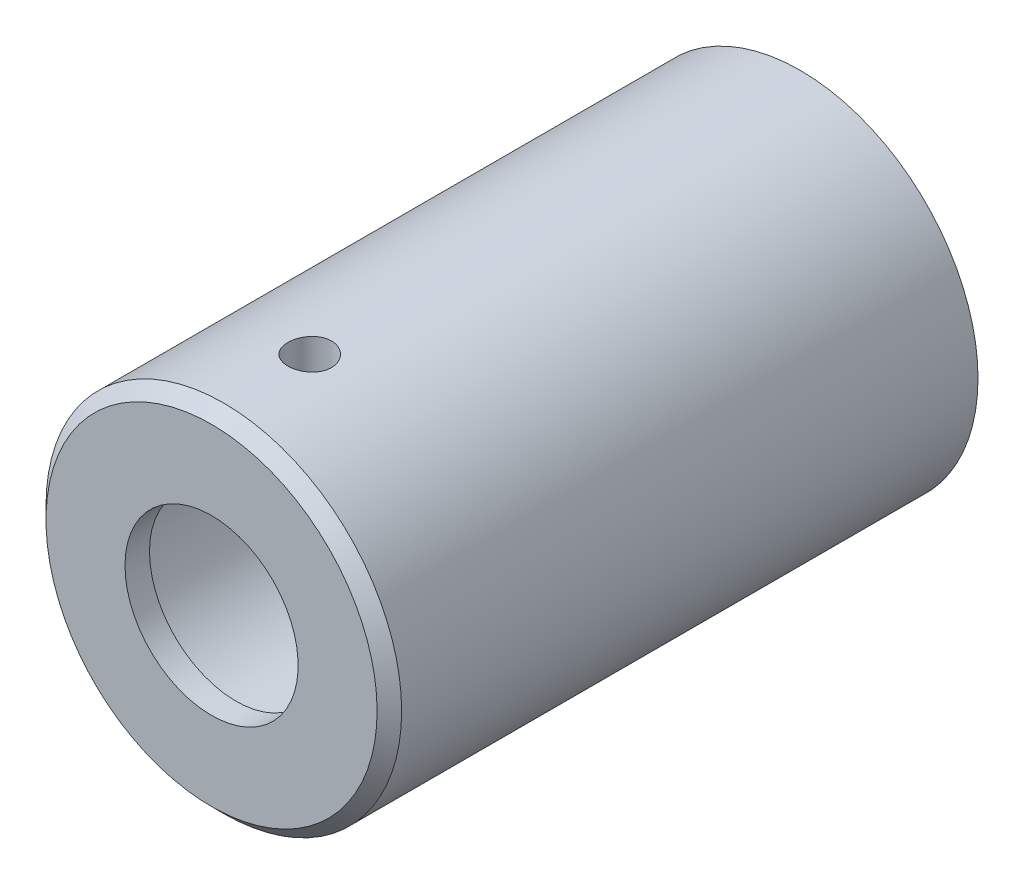
ISO-10303-21;
HEADER;
FILE_DESCRIPTION(('STEP AP214'),'2;1');
FILE_NAME('part.step','',(''),(''),'','','');
FILE_SCHEMA(('AUTOMOTIVE_DESIGN { 1 0 10303 214 1 1 1 1 }'));
ENDSEC;
DATA;
#1=APPLICATION_CONTEXT('core data for automotive mechanical design processes');
#2=APPLICATION_PROTOCOL_DEFINITION('international standard','automotive_design',2000,#1);
#3=PRODUCT_CONTEXT('',#1,'mechanical');
#4=PRODUCT('Part','Part','',(#3));
#5=PRODUCT_RELATED_PRODUCT_CATEGORY('part','',(#4));
#6=PRODUCT_DEFINITION_FORMATION('','',#4);
#7=PRODUCT_DEFINITION_CONTEXT('part definition',#1,'design');
#8=PRODUCT_DEFINITION('design','',#6,#7);
#9=PRODUCT_DEFINITION_SHAPE('','',#8);
#10=(LENGTH_UNIT() NAMED_UNIT(*) SI_UNIT(.MILLI.,.METRE.));
#11=(NAMED_UNIT(*) PLANE_ANGLE_UNIT() SI_UNIT($,.RADIAN.));
#12=(NAMED_UNIT(*) SI_UNIT($,.STERADIAN.) SOLID_ANGLE_UNIT());
#13=UNCERTAINTY_MEASURE_WITH_UNIT(LENGTH_MEASURE(1.E-05),#10,'distance_accuracy_value','');
#14=(GEOMETRIC_REPRESENTATION_CONTEXT(3) GLOBAL_UNCERTAINTY_ASSIGNED_CONTEXT((#13)) GLOBAL_UNIT_ASSIGNED_CONTEXT((#10,
#11,#12)) REPRESENTATION_CONTEXT('',''));
#15=CARTESIAN_POINT('',(0.,0.,0.));
#16=DIRECTION('',(0.,0.,1.));
#17=DIRECTION('',(1.,0.,0.));
#18=AXIS2_PLACEMENT_3D('',#15,#16,#17);
#19=CARTESIAN_POINT('',(0.,4.53,-24.));
#20=DIRECTION('',(0.,0.,-1.));
#21=DIRECTION('',(-1.,0.,0.));
#22=AXIS2_PLACEMENT_3D('',#19,#20,#21);
#23=PLANE('',#22);
#24=CARTESIAN_POINT('',(0.,0.,-24.));
#25=DIRECTION('',(0.,0.,-1.));
#26=DIRECTION('',(-1.,0.,0.));
#27=AXIS2_PLACEMENT_3D('',#24,#25,#26);
#28=CIRCLE('',#27,7.25);
#29=CARTESIAN_POINT('',(-7.25,0.,-24.));
#30=VERTEX_POINT('',#29);
#31=EDGE_CURVE('E43',#30,#30,#28,.T.);
#32=ORIENTED_EDGE('',*,*,#31,.T.);
#33=EDGE_LOOP('',(#32));
#34=FACE_BOUND('',#33,.T.);
#35=CARTESIAN_POINT('',(0.,0.,-24.));
#36=DIRECTION('',(0.,0.,-1.));
#37=DIRECTION('',(-1.,0.,0.));
#38=AXIS2_PLACEMENT_3D('',#35,#36,#37);
#39=CIRCLE('',#38,4.53);
#40=CARTESIAN_POINT('',(-4.53,0.,-24.));
#41=VERTEX_POINT('',#40);
#42=EDGE_CURVE('E58',#41,#41,#39,.T.);
#43=ORIENTED_EDGE('',*,*,#42,.F.);
#44=EDGE_LOOP('',(#43));
#45=FACE_BOUND('',#44,.T.);
#46=ADVANCED_FACE('F32',(#34,#45),#23,.T.);
#47=CARTESIAN_POINT('',(0.,0.,0.));
#48=DIRECTION('',(0.,0.,-1.));
#49=DIRECTION('',(-1.,0.,0.));
#50=AXIS2_PLACEMENT_3D('',#47,#48,#49);
#51=CYLINDRICAL_SURFACE('',#50,7.25);
#52=CARTESIAN_POINT('',(0.,0.,-0.499999999999999));
#53=DIRECTION('',(0.,0.,1.));
#54=DIRECTION('',(1.,0.,0.));
#55=AXIS2_PLACEMENT_3D('',#52,#53,#54);
#56=CIRCLE('',#55,7.25);
#57=CARTESIAN_POINT('',(7.25,0.,-0.499999999999999));
#58=VERTEX_POINT('',#57);
#59=EDGE_CURVE('E39',#58,#58,#56,.F.);
#60=ORIENTED_EDGE('',*,*,#59,.T.);
#61=EDGE_LOOP('',(#60));
#62=FACE_BOUND('',#61,.T.);
#63=CARTESIAN_POINT('',(0.,7.25,-3.11100000000001));
#64=CARTESIAN_POINT('',(0.0497352922699092,7.24999931697813,-3.11100211761038));
#65=CARTESIAN_POINT('',(0.0995018523333256,7.24948281239291,-3.11518774716117));
#66=CARTESIAN_POINT('',(0.197650674020543,7.24747205372098,-3.13181927393568));
#67=CARTESIAN_POINT('',(0.246031426156918,7.24597677284092,-3.14427384595787));
#68=CARTESIAN_POINT('',(0.339973476370009,7.24217694854555,-3.17707125905344));
#69=CARTESIAN_POINT('',(0.38553662858214,7.23987294412588,-3.19740884721691));
#70=CARTESIAN_POINT('',(0.472594314353672,7.2347120683669,-3.24538362497414));
#71=CARTESIAN_POINT('',(0.514089555668255,7.23185529345944,-3.27301954166703));
#72=CARTESIAN_POINT('',(0.592062498387777,7.22589099328054,-3.33496332942016));
#73=CARTESIAN_POINT('',(0.628515509153612,7.22278234466244,-3.3693021752525));
#74=CARTESIAN_POINT('',(0.695156622414393,7.21667374242024,-3.44361059622368));
#75=CARTESIAN_POINT('',(0.725344408829311,7.21367379428638,-3.48358045527595));
#76=CARTESIAN_POINT('',(0.778689694627338,7.20811116600053,-3.56817620015927));
#77=CARTESIAN_POINT('',(0.80182413660203,7.20554993171128,-3.61281672903529));
#78=CARTESIAN_POINT('',(0.840258784697372,7.20116946177545,-3.70538588200392));
#79=CARTESIAN_POINT('',(0.855559276941294,7.19935019902995,-3.75331438593566));
#80=CARTESIAN_POINT('',(0.877816844413402,7.19667033484917,-3.85084311284086));
#81=CARTESIAN_POINT('',(0.884815544037141,7.19580495230992,-3.90043370282685));
#82=CARTESIAN_POINT('',(0.890399645288686,7.19511618002055,-4.00009252374081));
#83=CARTESIAN_POINT('',(0.8889853729239,7.19529274989418,-4.05016073608559));
#84=CARTESIAN_POINT('',(0.877817858973771,7.19666355739408,-4.14906379228413));
#85=CARTESIAN_POINT('',(0.868110426056394,7.19785220452091,-4.19790389705066));
#86=CARTESIAN_POINT('',(0.840703601632715,7.20110451541398,-4.29325658464418));
#87=CARTESIAN_POINT('',(0.823004053789628,7.20316819629703,-4.33976912192097));
#88=CARTESIAN_POINT('',(0.780066049087814,7.20794439905849,-4.42928891435415));
#89=CARTESIAN_POINT('',(0.754807642233926,7.21065863411415,-4.47228650540085));
#90=CARTESIAN_POINT('',(0.697483191088242,7.2164287828661,-4.55344997901832));
#91=CARTESIAN_POINT('',(0.665416847107145,7.21948471160115,-4.59161564876703));
#92=CARTESIAN_POINT('',(0.595132687336998,7.22561878012687,-4.66229781656556));
#93=CARTESIAN_POINT('',(0.556875378804248,7.22869693246896,-4.69477505606742));
#94=CARTESIAN_POINT('',(0.47543137341361,7.23450958511776,-4.75285292422503));
#95=CARTESIAN_POINT('',(0.432244665906794,7.23724408468207,-4.77845353802488));
#96=CARTESIAN_POINT('',(0.342137820428609,7.24206293476913,-4.82205130889416));
#97=CARTESIAN_POINT('',(0.295216504987598,7.24414707921677,-4.84004605656581));
#98=CARTESIAN_POINT('',(0.198987041047732,7.24742850301708,-4.86789037524585));
#99=CARTESIAN_POINT('',(0.149679000159433,7.24862582231453,-4.87774031311876));
#100=CARTESIAN_POINT('',(0.0504152632149692,7.24999350483213,-4.88896463920892));
#101=CARTESIAN_POINT('',(0.00046577018452016,7.25017042185076,-4.89039311775059));
#102=CARTESIAN_POINT('',(-0.098960699388949,7.24949504839123,-4.88487665017888));
#103=CARTESIAN_POINT('',(-0.148437685586031,7.24864277898653,-4.8779318755148));
#104=CARTESIAN_POINT('',(-0.24535543245841,7.24600888960808,-4.85591096733972));
#105=CARTESIAN_POINT('',(-0.292802128916307,7.2442302123803,-4.84086057629803));
#106=CARTESIAN_POINT('',(-0.384498038582742,7.23994268370676,-4.80308239203133));
#107=CARTESIAN_POINT('',(-0.42874714690492,7.23743380832281,-4.78035434710478));
#108=CARTESIAN_POINT('',(-0.513033693913479,7.23194934772569,-4.72773481096242));
#109=CARTESIAN_POINT('',(-0.55304910391103,7.22897150458495,-4.69780827330644));
#110=CARTESIAN_POINT('',(-0.627508361609754,7.22288941614302,-4.63169090706813));
#111=CARTESIAN_POINT('',(-0.661951996692432,7.21978516602381,-4.59549983954086));
#112=CARTESIAN_POINT('',(-0.724481460861173,7.21377996280567,-4.51764271202781));
#113=CARTESIAN_POINT('',(-0.752531471234871,7.21088021500843,-4.47594777846041));
#114=CARTESIAN_POINT('',(-0.801230126476004,7.20563201576895,-4.38840683481175));
#115=CARTESIAN_POINT('',(-0.821878914974824,7.20328355362852,-4.3425609053082));
#116=CARTESIAN_POINT('',(-0.855130786926389,7.19941197365016,-4.2481356973801));
#117=CARTESIAN_POINT('',(-0.867754181583738,7.19788677373559,-4.19956366055365));
#118=CARTESIAN_POINT('',(-0.884662397035577,7.19582838740433,-4.10096942415094));
#119=CARTESIAN_POINT('',(-0.888947589957609,7.19529515671684,-4.05094728939256));
#120=CARTESIAN_POINT('',(-0.889051108746924,7.19528233795547,-3.95122911031408));
#121=CARTESIAN_POINT('',(-0.884925705720508,7.19579574733304,-3.90153311590346));
#122=CARTESIAN_POINT('',(-0.868444175055759,7.19780331840889,-3.80354645213736));
#123=CARTESIAN_POINT('',(-0.856088045521923,7.19929748033304,-3.75525578310552));
#124=CARTESIAN_POINT('',(-0.823513192192214,7.20309605975625,-3.66145725284445));
#125=CARTESIAN_POINT('',(-0.803297071011002,7.20540020902666,-3.61594847623621));
#126=CARTESIAN_POINT('',(-0.755581645206223,7.21055959778897,-3.52896021394426));
#127=CARTESIAN_POINT('',(-0.728082262949001,7.21341484315503,-3.48748077121643));
#128=CARTESIAN_POINT('',(-0.666371835114162,7.21937760228817,-3.40944086784945));
#129=CARTESIAN_POINT('',(-0.63211884097972,7.22248661770163,-3.3729136907962));
#130=CARTESIAN_POINT('',(-0.557960718602195,7.22859329490385,-3.30610385593002));
#131=CARTESIAN_POINT('',(-0.518054257625419,7.23159093022523,-3.27582267467777));
#132=CARTESIAN_POINT('',(-0.433554911709334,7.23714916705503,-3.22227052779852));
#133=CARTESIAN_POINT('',(-0.388945392649078,7.23970812715359,-3.19902565215418));
#134=CARTESIAN_POINT('',(-0.296449969487205,7.24408395977466,-3.16038993783773));
#135=CARTESIAN_POINT('',(-0.248567704593514,7.24590164139535,-3.14499053131043));
#136=CARTESIAN_POINT('',(-0.167029335955374,7.2481499943499,-3.1261851666672));
#137=CARTESIAN_POINT('',(-0.133888200296049,7.24884038186598,-3.12049887058892));
#138=CARTESIAN_POINT('',(-0.067169462329411,7.24976561375793,-3.11290558534904));
#139=CARTESIAN_POINT('',(-0.0335918630783108,7.25000046132186,-3.11099856973843));
#140=CARTESIAN_POINT('',(0.,7.25,-3.11100000000001));
#141=B_SPLINE_CURVE_WITH_KNOTS('',3,(#63,#64,#65,#66,#67,#68,#69,#70,#71,#72,#73,#74,#75,#76,
#77,#78,#79,#80,#81,#82,#83,#84,#85,#86,#87,#88,#89,#90,#91,#92,#93,#94,#95,#96,#97,#98,#99,
#100,#101,#102,#103,#104,#105,#106,#107,#108,#109,#110,#111,#112,#113,#114,#115,#116,#117,#118,
#119,#120,#121,#122,#123,#124,#125,#126,#127,#128,#129,#130,#131,#132,#133,#134,#135,#136,#137,
#138,#139,#140),.UNSPECIFIED.,.T.,.F.,(4,2,2,2,2,2,2,2,2,2,2,2,2,2,2,2,2,2,2,2,2,2,2,2,2,2,2,2,
2,2,2,2,2,2,2,2,2,2,4),(0.,0.149083180116906,0.298323008363875,0.447463559968257,
0.596578117140614,0.746398793888876,0.89622702724099,1.04653992398798,1.19684733039001,
1.34639788068819,1.49594263585598,1.64466665701524,1.79339358754741,1.94251656586935,
2.09164611003204,2.24176745709719,2.39188912847402,2.54205832004383,2.69222074721381,
2.84141763384704,2.99061146560209,3.13933424583398,3.28806190221518,3.43752885328598,
3.58700150665918,3.73729201800995,3.88757961259866,4.0374853190147,4.18738433510071,
4.33628374316099,4.48518318551221,4.63403336594291,4.78288513305967,4.93269236708577,
5.08253497523027,5.23292656589304,5.38315356341643,5.48384698640734,5.58453970470059),.UNSPECIFIED.);
#142=CARTESIAN_POINT('',(0.,7.25,-3.11100000000001));
#143=VERTEX_POINT('',#142);
#144=EDGE_CURVE('E61',#143,#143,#141,.T.);
#145=ORIENTED_EDGE('',*,*,#144,.F.);
#146=EDGE_LOOP('',(#145));
#147=FACE_BOUND('',#146,.T.);
#148=ORIENTED_EDGE('',*,*,#31,.F.);
#149=EDGE_LOOP('',(#148));
#150=FACE_BOUND('',#149,.T.);
#151=ADVANCED_FACE('F72',(#62,#147,#150),#51,.T.);
#152=CARTESIAN_POINT('',(0.,7.25,0.));
#153=DIRECTION('',(0.,0.,1.));
#154=DIRECTION('',(1.,0.,0.));
#155=AXIS2_PLACEMENT_3D('',#152,#153,#154);
#156=PLANE('',#155);
#157=CARTESIAN_POINT('',(0.,0.,0.));
#158=DIRECTION('',(0.,0.,1.));
#159=DIRECTION('',(1.,0.,0.));
#160=AXIS2_PLACEMENT_3D('',#157,#158,#159);
#161=CIRCLE('',#160,6.75);
#162=CARTESIAN_POINT('',(6.75,0.,0.));
#163=VERTEX_POINT('',#162);
#164=EDGE_CURVE('E10',#163,#163,#161,.T.);
#165=ORIENTED_EDGE('',*,*,#164,.T.);
#166=EDGE_LOOP('',(#165));
#167=FACE_BOUND('',#166,.T.);
#168=CARTESIAN_POINT('',(0.,0.,0.));
#169=DIRECTION('',(0.,0.,-1.));
#170=DIRECTION('',(-1.,0.,0.));
#171=AXIS2_PLACEMENT_3D('',#168,#169,#170);
#172=CIRCLE('',#171,3.53);
#173=CARTESIAN_POINT('',(-3.53,0.,0.));
#174=VERTEX_POINT('',#173);
#175=EDGE_CURVE('E47',#174,#174,#172,.T.);
#176=ORIENTED_EDGE('',*,*,#175,.T.);
#177=EDGE_LOOP('',(#176));
#178=FACE_BOUND('',#177,.T.);
#179=ADVANCED_FACE('F92',(#167,#178),#156,.T.);
#180=CARTESIAN_POINT('',(0.,0.,0.));
#181=DIRECTION('',(0.,0.,-1.));
#182=DIRECTION('',(-1.,0.,0.));
#183=AXIS2_PLACEMENT_3D('',#180,#181,#182);
#184=CYLINDRICAL_SURFACE('',#183,3.53);
#185=CARTESIAN_POINT('',(0.,0.,-0.999999999999998));
#186=DIRECTION('',(0.,0.,-1.));
#187=DIRECTION('',(-1.,0.,0.));
#188=AXIS2_PLACEMENT_3D('',#185,#186,#187);
#189=CIRCLE('',#188,3.53);
#190=CARTESIAN_POINT('',(-3.53,0.,-0.999999999999998));
#191=VERTEX_POINT('',#190);
#192=EDGE_CURVE('E52',#191,#191,#189,.T.);
#193=ORIENTED_EDGE('',*,*,#192,.T.);
#194=EDGE_LOOP('',(#193));
#195=FACE_BOUND('',#194,.T.);
#196=ORIENTED_EDGE('',*,*,#175,.F.);
#197=EDGE_LOOP('',(#196));
#198=FACE_BOUND('',#197,.T.);
#199=ADVANCED_FACE('F89',(#195,#198),#184,.F.);
#200=CARTESIAN_POINT('',(0.,3.53,-0.999999999999998));
#201=DIRECTION('',(0.,0.,-1.));
#202=DIRECTION('',(-1.,0.,0.));
#203=AXIS2_PLACEMENT_3D('',#200,#201,#202);
#204=PLANE('',#203);
#205=CARTESIAN_POINT('',(0.,0.,-0.999999999999998));
#206=DIRECTION('',(0.,0.,-1.));
#207=DIRECTION('',(-1.,0.,0.));
#208=AXIS2_PLACEMENT_3D('',#205,#206,#207);
#209=CIRCLE('',#208,4.53);
#210=CARTESIAN_POINT('',(-4.53,0.,-0.999999999999998));
#211=VERTEX_POINT('',#210);
#212=EDGE_CURVE('E55',#211,#211,#209,.T.);
#213=ORIENTED_EDGE('',*,*,#212,.T.);
#214=EDGE_LOOP('',(#213));
#215=FACE_BOUND('',#214,.T.);
#216=ORIENTED_EDGE('',*,*,#192,.F.);
#217=EDGE_LOOP('',(#216));
#218=FACE_BOUND('',#217,.T.);
#219=ADVANCED_FACE('F85',(#215,#218),#204,.T.);
#220=CARTESIAN_POINT('',(0.,0.,0.));
#221=DIRECTION('',(0.,0.,-1.));
#222=DIRECTION('',(-1.,0.,0.));
#223=AXIS2_PLACEMENT_3D('',#220,#221,#222);
#224=CYLINDRICAL_SURFACE('',#223,4.53);
#225=CARTESIAN_POINT('',(0.,4.53,-3.11100000000001));
#226=CARTESIAN_POINT('',(-0.0494272028045968,4.5299990926963,-3.11100184069149));
#227=CARTESIAN_POINT('',(-0.0988778804486155,4.52918272559746,-3.11513605723352));
#228=CARTESIAN_POINT('',(-0.196382779570254,4.5260048015564,-3.13155132154202));
#229=CARTESIAN_POINT('',(-0.244435837517874,4.52364199359213,-3.14383896528628));
#230=CARTESIAN_POINT('',(-0.337721526088852,4.51763517306436,-3.17616793740205));
#231=CARTESIAN_POINT('',(-0.382956764682739,4.51399236655766,-3.19620196865021));
#232=CARTESIAN_POINT('',(-0.469420465908012,4.50582210251521,-3.2434336326627));
#233=CARTESIAN_POINT('',(-0.510649193048684,4.50129470343961,-3.27063079207793));
#234=CARTESIAN_POINT('',(-0.588471568793466,4.49178784991245,-3.33179349303954));
#235=CARTESIAN_POINT('',(-0.625005329564087,4.48680372532722,-3.36583451654514));
#236=CARTESIAN_POINT('',(-0.691882295887206,4.47697934789197,-3.43955634990106));
#237=CARTESIAN_POINT('',(-0.722225030134286,4.47213910601928,-3.47923758873523));
#238=CARTESIAN_POINT('',(-0.776111750750186,4.46310498659198,-3.56354191814533));
#239=CARTESIAN_POINT('',(-0.79959405995936,4.45891712184191,-3.60820513358018));
#240=CARTESIAN_POINT('',(-0.838698318360398,4.45172808972564,-3.70093881538037));
#241=CARTESIAN_POINT('',(-0.854321013604159,4.44872680973198,-3.74900895785829));
#242=CARTESIAN_POINT('',(-0.877068831262215,4.44429793961084,-3.84654869566556));
#243=CARTESIAN_POINT('',(-0.884298835542167,4.4428509433655,-3.89599293190268));
#244=CARTESIAN_POINT('',(-0.8903817417976,4.4416360343245,-3.99541218558354));
#245=CARTESIAN_POINT('',(-0.889235467885635,4.44186795634597,-4.04538715032768));
#246=CARTESIAN_POINT('',(-0.878683230184491,4.44396703653694,-4.14368422004268));
#247=CARTESIAN_POINT('',(-0.869397200397988,4.44581044937628,-4.19201978246013));
#248=CARTESIAN_POINT('',(-0.843018225560409,4.45088744440308,-4.28643335941687));
#249=CARTESIAN_POINT('',(-0.825924920218851,4.45412109074669,-4.33251126966125));
#250=CARTESIAN_POINT('',(-0.784301243166258,4.46163864645701,-4.42144881400644));
#251=CARTESIAN_POINT('',(-0.759723061613294,4.4659292726165,-4.4642854813719));
#252=CARTESIAN_POINT('',(-0.7038610740262,4.47507299103852,-4.54527158884699));
#253=CARTESIAN_POINT('',(-0.672576524886941,4.47992614560513,-4.58342050878897));
#254=CARTESIAN_POINT('',(-0.603546336136731,4.48975114539919,-4.65464053833154));
#255=CARTESIAN_POINT('',(-0.565698265878122,4.49472359131939,-4.68761236407823));
#256=CARTESIAN_POINT('',(-0.484956514822171,4.50414992331912,-4.74675458053263));
#257=CARTESIAN_POINT('',(-0.442062773850268,4.50860380321298,-4.77292489011365));
#258=CARTESIAN_POINT('',(-0.352339054619608,4.51650149987708,-4.81773841150293));
#259=CARTESIAN_POINT('',(-0.305503425847159,4.51994383379287,-4.83637058786047));
#260=CARTESIAN_POINT('',(-0.209284274836432,4.52541926694745,-4.86547477038605));
#261=CARTESIAN_POINT('',(-0.159901050278713,4.52745253043385,-4.87594772764729));
#262=CARTESIAN_POINT('',(-0.0608420026757443,4.52985795092272,-4.88829634751364));
#263=CARTESIAN_POINT('',(-0.0111837410791781,4.53025636703117,-4.89030793101535));
#264=CARTESIAN_POINT('',(0.0877594052131493,4.52942001613449,-4.88604230688486));
#265=CARTESIAN_POINT('',(0.137044309938779,4.52818533737477,-4.87976554711899));
#266=CARTESIAN_POINT('',(0.233405493739249,4.52423793406912,-4.85921435990725));
#267=CARTESIAN_POINT('',(0.280497155637627,4.52153804925412,-4.84500937785806));
#268=CARTESIAN_POINT('',(0.371630310466684,4.5149618134505,-4.80908063420943));
#269=CARTESIAN_POINT('',(0.415671581003419,4.51108537679403,-4.78735632509174));
#270=CARTESIAN_POINT('',(0.500029115272376,4.50252059056816,-4.7367094779194));
#271=CARTESIAN_POINT('',(0.540295083269709,4.49782316869694,-4.70770473345482));
#272=CARTESIAN_POINT('',(0.615437073508013,4.48815942549149,-4.64343078228297));
#273=CARTESIAN_POINT('',(0.650312540161089,4.48319307651063,-4.60816093064809));
#274=CARTESIAN_POINT('',(0.714205647179778,4.47346313058464,-4.53174021767527));
#275=CARTESIAN_POINT('',(0.74313014317411,4.46870356185832,-4.49051088050125));
#276=CARTESIAN_POINT('',(0.793643367522919,4.46001007331086,-4.40369892533148));
#277=CARTESIAN_POINT('',(0.815232383451107,4.45607612112528,-4.35811647808098));
#278=CARTESIAN_POINT('',(0.85033314029697,4.44951153337151,-4.26411784768288));
#279=CARTESIAN_POINT('',(0.863885913672449,4.44687428892177,-4.21571747021561));
#280=CARTESIAN_POINT('',(0.882654590106827,4.44318736867938,-4.11726941966216));
#281=CARTESIAN_POINT('',(0.887871534918134,4.44213749450939,-4.06722195321538));
#282=CARTESIAN_POINT('',(0.889783034988435,4.44175490943684,-3.96783488866942));
#283=CARTESIAN_POINT('',(0.886624692161773,4.44239255880435,-3.9184981747067));
#284=CARTESIAN_POINT('',(0.872199131141729,4.44524710336302,-3.82107379573036));
#285=CARTESIAN_POINT('',(0.860931972784674,4.44746398690073,-3.77298612150258));
#286=CARTESIAN_POINT('',(0.830673157010048,4.45321419486597,-3.67951401991231));
#287=CARTESIAN_POINT('',(0.811698892950794,4.4567445535514,-3.63412376770051));
#288=CARTESIAN_POINT('',(0.76658110744716,4.46472574247415,-3.54714780331512));
#289=CARTESIAN_POINT('',(0.740437013531632,4.46917664620491,-3.50556239529098));
#290=CARTESIAN_POINT('',(0.681216520576152,4.47858851524293,-3.42664274161017));
#291=CARTESIAN_POINT('',(0.648033633130549,4.48355663827334,-3.3893892430342));
#292=CARTESIAN_POINT('',(0.575898037278226,4.49339113170618,-3.32093046082755));
#293=CARTESIAN_POINT('',(0.536944005189447,4.498257478472,-3.28972656854806));
#294=CARTESIAN_POINT('',(0.453903729480707,4.50739746189967,-3.23395875556258));
#295=CARTESIAN_POINT('',(0.409770018336193,4.51166467835543,-3.20946442307356));
#296=CARTESIAN_POINT('',(0.317942307812273,4.51906257842248,-3.1682782677812));
#297=CARTESIAN_POINT('',(0.270251605466088,4.52219429913878,-3.15157932103348));
#298=CARTESIAN_POINT('',(0.185369511092431,4.52635068710764,-3.12974023442472));
#299=CARTESIAN_POINT('',(0.14866544628127,4.52771125720511,-3.1227250154086));
#300=CARTESIAN_POINT('',(0.0746453720487569,4.52953624291625,-3.11335427253471));
#301=CARTESIAN_POINT('',(0.0373293808942813,4.53000068523168,-3.11099860983691));
#302=CARTESIAN_POINT('',(0.,4.53,-3.11100000000001));
#303=B_SPLINE_CURVE_WITH_KNOTS('',3,(#225,#226,#227,#228,#229,#230,#231,#232,#233,#234,#235,
#236,#237,#238,#239,#240,#241,#242,#243,#244,#245,#246,#247,#248,#249,#250,#251,#252,#253,#254,
#255,#256,#257,#258,#259,#260,#261,#262,#263,#264,#265,#266,#267,#268,#269,#270,#271,#272,#273,
#274,#275,#276,#277,#278,#279,#280,#281,#282,#283,#284,#285,#286,#287,#288,#289,#290,#291,#292,
#293,#294,#295,#296,#297,#298,#299,#300,#301,#302),.UNSPECIFIED.,.T.,.F.,(4,2,2,2,2,2,2,2,2,2,2,
2,2,2,2,2,2,2,2,2,2,2,2,2,2,2,2,2,2,2,2,2,2,2,2,2,2,2,4),(0.,0.148145060626058,
0.296410114328209,0.444535840776731,0.592651781333753,0.742501038484216,0.892361698983961,
1.04353087990623,1.19468570880766,1.34393052686694,1.49316066145114,1.6402282637961,
1.78730265370883,1.93533692301807,2.08338760388502,2.2340000276921,2.38461424788185,
2.53544816879383,2.68626450486243,2.83464869647559,2.98302487037497,3.13012132575149,
3.2772284941799,3.42607795764679,3.57494275250644,3.72598500073854,3.87702132695977,
4.02727967984571,4.17751925304513,4.32513759982639,4.47275485731797,4.62004080764504,
4.76733852136393,4.91704780371,5.06679147700941,5.21803399107013,5.36913801772396,
5.48102636807928,5.59291138446549),.UNSPECIFIED.);
#304=CARTESIAN_POINT('',(0.,4.53,-3.11100000000001));
#305=VERTEX_POINT('',#304);
#306=EDGE_CURVE('E68',#305,#305,#303,.T.);
#307=ORIENTED_EDGE('',*,*,#306,.F.);
#308=EDGE_LOOP('',(#307));
#309=FACE_BOUND('',#308,.T.);
#310=ORIENTED_EDGE('',*,*,#42,.T.);
#311=EDGE_LOOP('',(#310));
#312=FACE_BOUND('',#311,.T.);
#313=ORIENTED_EDGE('',*,*,#212,.F.);
#314=EDGE_LOOP('',(#313));
#315=FACE_BOUND('',#314,.T.);
#316=ADVANCED_FACE('F78',(#309,#312,#315),#224,.F.);
#317=CARTESIAN_POINT('',(0.,7.25,-4.));
#318=DIRECTION('',(0.,1.,0.));
#319=DIRECTION('',(0.,0.,1.));
#320=AXIS2_PLACEMENT_3D('',#317,#318,#319);
#321=CYLINDRICAL_SURFACE('',#320,0.888999999999993);
#322=ORIENTED_EDGE('',*,*,#144,.T.);
#323=EDGE_LOOP('',(#322));
#324=FACE_BOUND('',#323,.T.);
#325=ORIENTED_EDGE('',*,*,#306,.T.);
#326=EDGE_LOOP('',(#325));
#327=FACE_BOUND('',#326,.T.);
#328=ADVANCED_FACE('F75',(#324,#327),#321,.F.);
#329=CARTESIAN_POINT('',(0.,0.,-0.499999999999999));
#330=DIRECTION('',(0.,0.,-1.));
#331=DIRECTION('',(-1.,0.,0.));
#332=AXIS2_PLACEMENT_3D('',#329,#330,#331);
#333=CONICAL_SURFACE('',#332,7.25,0.785398163397451);
#334=ORIENTED_EDGE('',*,*,#164,.F.);
#335=EDGE_LOOP('',(#334));
#336=FACE_BOUND('',#335,.T.);
#337=ORIENTED_EDGE('',*,*,#59,.F.);
#338=EDGE_LOOP('',(#337));
#339=FACE_BOUND('',#338,.T.);
#340=ADVANCED_FACE('F34',(#336,#339),#333,.T.);
#341=CLOSED_SHELL('',(#46,#151,#179,#199,#219,#316,#328,#340));
#342=MANIFOLD_SOLID_BREP('B2',#341);
#343=ADVANCED_BREP_SHAPE_REPRESENTATION('',(#18,#342),#14);
#344=SHAPE_DEFINITION_REPRESENTATION(#9,#343);
ENDSEC;
END-ISO-10303-21;
